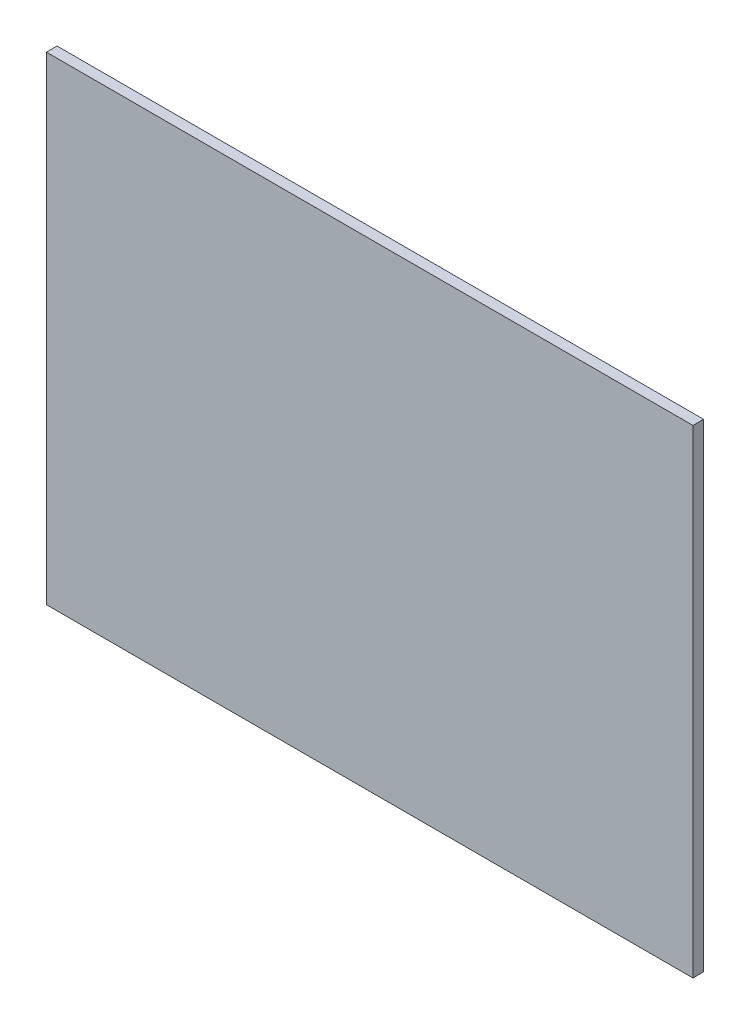
ISO-10303-21;
HEADER;
FILE_DESCRIPTION(('STEP AP214'),'2;1');
FILE_NAME('part.step','',(''),(''),'','','');
FILE_SCHEMA(('AUTOMOTIVE_DESIGN { 1 0 10303 214 1 1 1 1 }'));
ENDSEC;
DATA;
#1=APPLICATION_CONTEXT('core data for automotive mechanical design processes');
#2=APPLICATION_PROTOCOL_DEFINITION('international standard','automotive_design',2000,#1);
#3=PRODUCT_CONTEXT('',#1,'mechanical');
#4=PRODUCT('Part','Part','',(#3));
#5=PRODUCT_RELATED_PRODUCT_CATEGORY('part','',(#4));
#6=PRODUCT_DEFINITION_FORMATION('','',#4);
#7=PRODUCT_DEFINITION_CONTEXT('part definition',#1,'design');
#8=PRODUCT_DEFINITION('design','',#6,#7);
#9=PRODUCT_DEFINITION_SHAPE('','',#8);
#10=(LENGTH_UNIT() NAMED_UNIT(*) SI_UNIT(.MILLI.,.METRE.));
#11=(NAMED_UNIT(*) PLANE_ANGLE_UNIT() SI_UNIT($,.RADIAN.));
#12=(NAMED_UNIT(*) SI_UNIT($,.STERADIAN.) SOLID_ANGLE_UNIT());
#13=UNCERTAINTY_MEASURE_WITH_UNIT(LENGTH_MEASURE(1.E-05),#10,'distance_accuracy_value','');
#14=(GEOMETRIC_REPRESENTATION_CONTEXT(3) GLOBAL_UNCERTAINTY_ASSIGNED_CONTEXT((#13)) GLOBAL_UNIT_ASSIGNED_CONTEXT((#10,
#11,#12)) REPRESENTATION_CONTEXT('',''));
#15=CARTESIAN_POINT('',(0.,0.,0.));
#16=DIRECTION('',(0.,0.,1.));
#17=DIRECTION('',(1.,0.,0.));
#18=AXIS2_PLACEMENT_3D('',#15,#16,#17);
#19=CARTESIAN_POINT('',(-152.,-112.5,2.5));
#20=DIRECTION('',(1.,0.,0.));
#21=DIRECTION('',(0.,0.,-1.));
#22=AXIS2_PLACEMENT_3D('',#19,#20,#21);
#23=PLANE('',#22);
#24=DIRECTION('',(0.,-1.,0.));
#25=VECTOR('',#24,1.);
#26=CARTESIAN_POINT('',(-152.,-112.5,-2.5));
#27=LINE('',#26,#25);
#28=CARTESIAN_POINT('',(-152.,112.5,-2.5));
#29=VERTEX_POINT('',#28);
#30=CARTESIAN_POINT('',(-152.,-112.5,-2.5));
#31=VERTEX_POINT('',#30);
#32=EDGE_CURVE('E100',#29,#31,#27,.T.);
#33=ORIENTED_EDGE('',*,*,#32,.T.);
#34=DIRECTION('',(0.,0.,-1.));
#35=VECTOR('',#34,1.);
#36=CARTESIAN_POINT('',(-152.,-112.5,2.5));
#37=LINE('',#36,#35);
#38=CARTESIAN_POINT('',(-152.,-112.5,2.5));
#39=VERTEX_POINT('',#38);
#40=EDGE_CURVE('E11',#39,#31,#37,.T.);
#41=ORIENTED_EDGE('',*,*,#40,.F.);
#42=DIRECTION('',(0.,-1.,0.));
#43=VECTOR('',#42,1.);
#44=CARTESIAN_POINT('',(-152.,-112.5,2.5));
#45=LINE('',#44,#43);
#46=CARTESIAN_POINT('',(-152.,112.5,2.5));
#47=VERTEX_POINT('',#46);
#48=EDGE_CURVE('E88',#47,#39,#45,.T.);
#49=ORIENTED_EDGE('',*,*,#48,.F.);
#50=DIRECTION('',(0.,0.,-1.));
#51=VECTOR('',#50,1.);
#52=CARTESIAN_POINT('',(-152.,112.5,2.5));
#53=LINE('',#52,#51);
#54=EDGE_CURVE('E96',#47,#29,#53,.T.);
#55=ORIENTED_EDGE('',*,*,#54,.T.);
#56=EDGE_LOOP('',(#33,#41,#49,#55));
#57=FACE_BOUND('',#56,.T.);
#58=ADVANCED_FACE('F37',(#57),#23,.F.);
#59=CARTESIAN_POINT('',(152.,-112.5,2.5));
#60=DIRECTION('',(0.,1.,0.));
#61=DIRECTION('',(-1.,0.,0.));
#62=AXIS2_PLACEMENT_3D('',#59,#60,#61);
#63=PLANE('',#62);
#64=DIRECTION('',(1.,0.,0.));
#65=VECTOR('',#64,1.);
#66=CARTESIAN_POINT('',(152.,-112.5,-2.5));
#67=LINE('',#66,#65);
#68=CARTESIAN_POINT('',(152.,-112.5,-2.5));
#69=VERTEX_POINT('',#68);
#70=EDGE_CURVE('E92',#31,#69,#67,.T.);
#71=ORIENTED_EDGE('',*,*,#70,.T.);
#72=DIRECTION('',(0.,0.,-1.));
#73=VECTOR('',#72,1.);
#74=CARTESIAN_POINT('',(152.,-112.5,2.5));
#75=LINE('',#74,#73);
#76=CARTESIAN_POINT('',(152.,-112.5,2.5));
#77=VERTEX_POINT('',#76);
#78=EDGE_CURVE('E45',#77,#69,#75,.T.);
#79=ORIENTED_EDGE('',*,*,#78,.F.);
#80=DIRECTION('',(1.,0.,0.));
#81=VECTOR('',#80,1.);
#82=CARTESIAN_POINT('',(152.,-112.5,2.5));
#83=LINE('',#82,#81);
#84=EDGE_CURVE('E83',#39,#77,#83,.T.);
#85=ORIENTED_EDGE('',*,*,#84,.F.);
#86=ORIENTED_EDGE('',*,*,#40,.T.);
#87=EDGE_LOOP('',(#71,#79,#85,#86));
#88=FACE_BOUND('',#87,.T.);
#89=ADVANCED_FACE('F91',(#88),#63,.F.);
#90=CARTESIAN_POINT('',(152.,-112.5,2.5));
#91=DIRECTION('',(-1.,0.,0.));
#92=DIRECTION('',(0.,0.,1.));
#93=AXIS2_PLACEMENT_3D('',#90,#91,#92);
#94=PLANE('',#93);
#95=DIRECTION('',(0.,1.,0.));
#96=VECTOR('',#95,1.);
#97=CARTESIAN_POINT('',(152.,-112.5,-2.5));
#98=LINE('',#97,#96);
#99=CARTESIAN_POINT('',(152.,112.5,-2.5));
#100=VERTEX_POINT('',#99);
#101=EDGE_CURVE('E70',#69,#100,#98,.T.);
#102=ORIENTED_EDGE('',*,*,#101,.T.);
#103=DIRECTION('',(0.,0.,-1.));
#104=VECTOR('',#103,1.);
#105=CARTESIAN_POINT('',(152.,112.5,2.5));
#106=LINE('',#105,#104);
#107=CARTESIAN_POINT('',(152.,112.5,2.5));
#108=VERTEX_POINT('',#107);
#109=EDGE_CURVE('E93',#108,#100,#106,.T.);
#110=ORIENTED_EDGE('',*,*,#109,.F.);
#111=DIRECTION('',(0.,1.,0.));
#112=VECTOR('',#111,1.);
#113=CARTESIAN_POINT('',(152.,-112.5,2.5));
#114=LINE('',#113,#112);
#115=EDGE_CURVE('E86',#77,#108,#114,.T.);
#116=ORIENTED_EDGE('',*,*,#115,.F.);
#117=ORIENTED_EDGE('',*,*,#78,.T.);
#118=EDGE_LOOP('',(#102,#110,#116,#117));
#119=FACE_BOUND('',#118,.T.);
#120=ADVANCED_FACE('F94',(#119),#94,.F.);
#121=CARTESIAN_POINT('',(152.,112.5,2.5));
#122=DIRECTION('',(0.,-1.,0.));
#123=DIRECTION('',(1.,0.,0.));
#124=AXIS2_PLACEMENT_3D('',#121,#122,#123);
#125=PLANE('',#124);
#126=DIRECTION('',(-1.,0.,0.));
#127=VECTOR('',#126,1.);
#128=CARTESIAN_POINT('',(152.,112.5,-2.5));
#129=LINE('',#128,#127);
#130=EDGE_CURVE('E76',#100,#29,#129,.T.);
#131=ORIENTED_EDGE('',*,*,#130,.T.);
#132=ORIENTED_EDGE('',*,*,#54,.F.);
#133=DIRECTION('',(-1.,0.,0.));
#134=VECTOR('',#133,1.);
#135=CARTESIAN_POINT('',(152.,112.5,2.5));
#136=LINE('',#135,#134);
#137=EDGE_CURVE('E53',#108,#47,#136,.T.);
#138=ORIENTED_EDGE('',*,*,#137,.F.);
#139=ORIENTED_EDGE('',*,*,#109,.T.);
#140=EDGE_LOOP('',(#131,#132,#138,#139));
#141=FACE_BOUND('',#140,.T.);
#142=ADVANCED_FACE('F107',(#141),#125,.F.);
#143=CARTESIAN_POINT('',(0.,0.,2.5));
#144=DIRECTION('',(0.,0.,1.));
#145=DIRECTION('',(1.,0.,0.));
#146=AXIS2_PLACEMENT_3D('',#143,#144,#145);
#147=PLANE('',#146);
#148=ORIENTED_EDGE('',*,*,#48,.T.);
#149=ORIENTED_EDGE('',*,*,#84,.T.);
#150=ORIENTED_EDGE('',*,*,#115,.T.);
#151=ORIENTED_EDGE('',*,*,#137,.T.);
#152=EDGE_LOOP('',(#148,#149,#150,#151));
#153=FACE_BOUND('',#152,.T.);
#154=ADVANCED_FACE('F84',(#153),#147,.T.);
#155=CARTESIAN_POINT('',(0.,0.,-2.5));
#156=DIRECTION('',(0.,0.,1.));
#157=DIRECTION('',(1.,0.,0.));
#158=AXIS2_PLACEMENT_3D('',#155,#156,#157);
#159=PLANE('',#158);
#160=ORIENTED_EDGE('',*,*,#32,.F.);
#161=ORIENTED_EDGE('',*,*,#130,.F.);
#162=ORIENTED_EDGE('',*,*,#101,.F.);
#163=ORIENTED_EDGE('',*,*,#70,.F.);
#164=EDGE_LOOP('',(#160,#161,#162,#163));
#165=FACE_BOUND('',#164,.T.);
#166=ADVANCED_FACE('F110',(#165),#159,.F.);
#167=CLOSED_SHELL('',(#58,#89,#120,#142,#154,#166));
#168=MANIFOLD_SOLID_BREP('B2',#167);
#169=ADVANCED_BREP_SHAPE_REPRESENTATION('',(#18,#168),#14);
#170=SHAPE_DEFINITION_REPRESENTATION(#9,#169);
ENDSEC;
END-ISO-10303-21;
